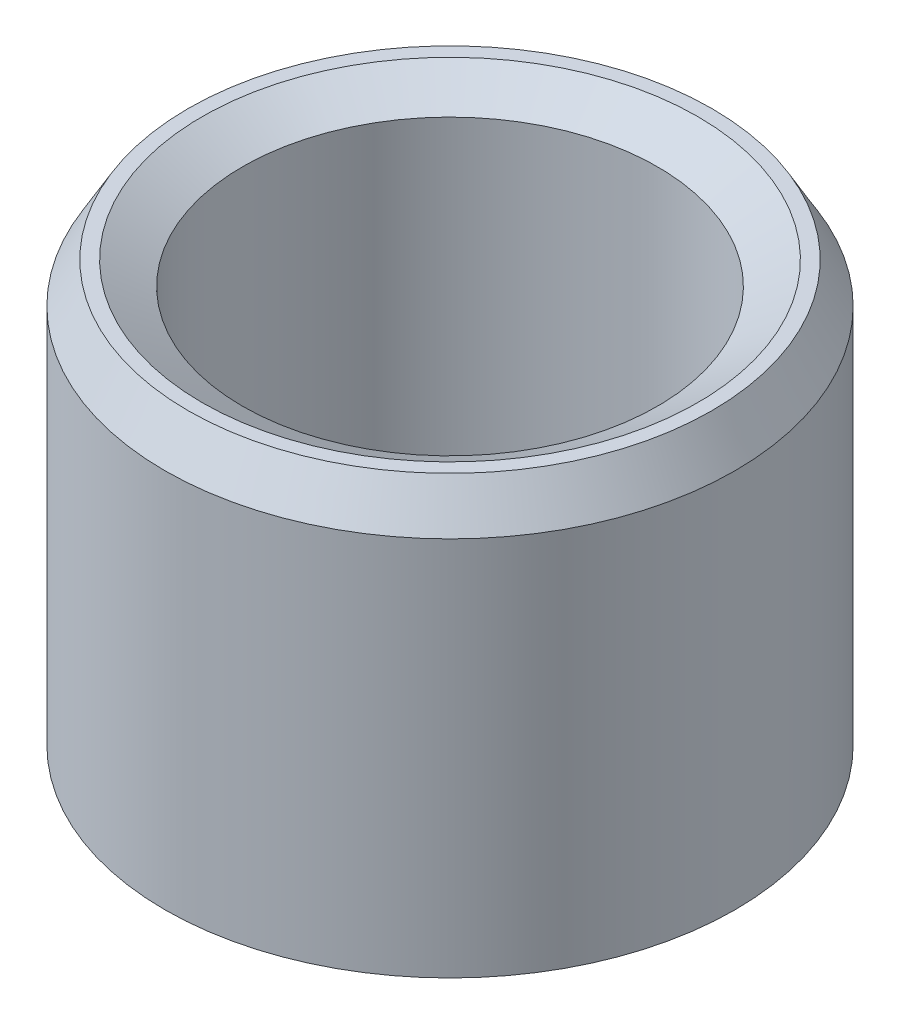
ISO-10303-21;
HEADER;
FILE_DESCRIPTION(('STEP AP214'),'2;1');
FILE_NAME('part.step','',(''),(''),'','','');
FILE_SCHEMA(('AUTOMOTIVE_DESIGN { 1 0 10303 214 1 1 1 1 }'));
ENDSEC;
DATA;
#1=APPLICATION_CONTEXT('core data for automotive mechanical design processes');
#2=APPLICATION_PROTOCOL_DEFINITION('international standard','automotive_design',2000,#1);
#3=PRODUCT_CONTEXT('',#1,'mechanical');
#4=PRODUCT('Part','Part','',(#3));
#5=PRODUCT_RELATED_PRODUCT_CATEGORY('part','',(#4));
#6=PRODUCT_DEFINITION_FORMATION('','',#4);
#7=PRODUCT_DEFINITION_CONTEXT('part definition',#1,'design');
#8=PRODUCT_DEFINITION('design','',#6,#7);
#9=PRODUCT_DEFINITION_SHAPE('','',#8);
#10=(LENGTH_UNIT() NAMED_UNIT(*) SI_UNIT(.MILLI.,.METRE.));
#11=(NAMED_UNIT(*) PLANE_ANGLE_UNIT() SI_UNIT($,.RADIAN.));
#12=(NAMED_UNIT(*) SI_UNIT($,.STERADIAN.) SOLID_ANGLE_UNIT());
#13=UNCERTAINTY_MEASURE_WITH_UNIT(LENGTH_MEASURE(1.E-05),#10,'distance_accuracy_value','');
#14=(GEOMETRIC_REPRESENTATION_CONTEXT(3) GLOBAL_UNCERTAINTY_ASSIGNED_CONTEXT((#13)) GLOBAL_UNIT_ASSIGNED_CONTEXT((#10,
#11,#12)) REPRESENTATION_CONTEXT('',''));
#15=CARTESIAN_POINT('',(0.,0.,0.));
#16=DIRECTION('',(0.,0.,1.));
#17=DIRECTION('',(1.,0.,0.));
#18=AXIS2_PLACEMENT_3D('',#15,#16,#17);
#19=CARTESIAN_POINT('',(0.,19.4621210670996,0.));
#20=DIRECTION('',(0.,-1.,0.));
#21=DIRECTION('',(0.,0.,-1.));
#22=AXIS2_PLACEMENT_3D('',#19,#20,#21);
#23=CYLINDRICAL_SURFACE('',#22,12.5);
#24=CARTESIAN_POINT('',(0.,1.02047988390466,0.));
#25=DIRECTION('',(0.,1.,0.));
#26=DIRECTION('',(0.,0.,1.));
#27=AXIS2_PLACEMENT_3D('',#24,#25,#26);
#28=CIRCLE('',#27,12.5);
#29=CARTESIAN_POINT('',(0.,1.02047988390466,12.5));
#30=VERTEX_POINT('',#29);
#31=EDGE_CURVE('E10',#30,#30,#28,.T.);
#32=ORIENTED_EDGE('',*,*,#31,.T.);
#33=EDGE_LOOP('',(#32));
#34=FACE_BOUND('',#33,.T.);
#35=CARTESIAN_POINT('',(0.,17.6945980600747,0.));
#36=DIRECTION('',(0.,1.,0.));
#37=DIRECTION('',(0.,0.,1.));
#38=AXIS2_PLACEMENT_3D('',#35,#36,#37);
#39=CIRCLE('',#38,12.5);
#40=CARTESIAN_POINT('',(0.,17.6945980600747,12.5));
#41=VERTEX_POINT('',#40);
#42=EDGE_CURVE('E50',#41,#41,#39,.F.);
#43=ORIENTED_EDGE('',*,*,#42,.T.);
#44=EDGE_LOOP('',(#43));
#45=FACE_BOUND('',#44,.T.);
#46=ADVANCED_FACE('F39',(#34,#45),#23,.T.);
#47=CARTESIAN_POINT('',(0.,19.4621210670996,0.));
#48=DIRECTION('',(0.,1.,0.));
#49=DIRECTION('',(0.,0.,1.));
#50=AXIS2_PLACEMENT_3D('',#47,#48,#49);
#51=PLANE('',#50);
#52=CARTESIAN_POINT('',(0.,19.4621210670996,0.));
#53=DIRECTION('',(0.,1.,0.));
#54=DIRECTION('',(0.,0.,1.));
#55=AXIS2_PLACEMENT_3D('',#52,#53,#54);
#56=CIRCLE('',#55,10.8651623211165);
#57=CARTESIAN_POINT('',(0.,19.4621210670996,10.8651623211165));
#58=VERTEX_POINT('',#57);
#59=EDGE_CURVE('E58',#58,#58,#56,.F.);
#60=ORIENTED_EDGE('',*,*,#59,.T.);
#61=EDGE_LOOP('',(#60));
#62=FACE_BOUND('',#61,.T.);
#63=CARTESIAN_POINT('',(0.,19.4621210670996,0.));
#64=DIRECTION('',(0.,1.,0.));
#65=DIRECTION('',(0.,0.,1.));
#66=AXIS2_PLACEMENT_3D('',#63,#64,#65);
#67=CIRCLE('',#66,11.4795201160953);
#68=CARTESIAN_POINT('',(0.,19.4621210670996,11.4795201160953));
#69=VERTEX_POINT('',#68);
#70=EDGE_CURVE('E61',#69,#69,#67,.T.);
#71=ORIENTED_EDGE('',*,*,#70,.T.);
#72=EDGE_LOOP('',(#71));
#73=FACE_BOUND('',#72,.T.);
#74=ADVANCED_FACE('F88',(#62,#73),#51,.T.);
#75=CARTESIAN_POINT('',(0.,0.,0.));
#76=DIRECTION('',(0.,1.,0.));
#77=DIRECTION('',(0.,0.,1.));
#78=AXIS2_PLACEMENT_3D('',#75,#76,#77);
#79=PLANE('',#78);
#80=CARTESIAN_POINT('',(0.,0.,0.));
#81=DIRECTION('',(0.,1.,0.));
#82=DIRECTION('',(0.,0.,1.));
#83=AXIS2_PLACEMENT_3D('',#80,#81,#82);
#84=CIRCLE('',#83,10.1181191979963);
#85=CARTESIAN_POINT('',(0.,0.,10.1181191979963));
#86=VERTEX_POINT('',#85);
#87=EDGE_CURVE('E51',#86,#86,#84,.T.);
#88=ORIENTED_EDGE('',*,*,#87,.T.);
#89=EDGE_LOOP('',(#88));
#90=FACE_BOUND('',#89,.T.);
#91=CARTESIAN_POINT('',(0.,0.,0.));
#92=DIRECTION('',(0.,1.,0.));
#93=DIRECTION('',(0.,0.,1.));
#94=AXIS2_PLACEMENT_3D('',#91,#92,#93);
#95=CIRCLE('',#94,10.7324769929751);
#96=CARTESIAN_POINT('',(0.,0.,10.7324769929751));
#97=VERTEX_POINT('',#96);
#98=EDGE_CURVE('E54',#97,#97,#95,.F.);
#99=ORIENTED_EDGE('',*,*,#98,.T.);
#100=EDGE_LOOP('',(#99));
#101=FACE_BOUND('',#100,.T.);
#102=ADVANCED_FACE('F83',(#90,#101),#79,.F.);
#103=CARTESIAN_POINT('',(0.,19.4621210670996,0.));
#104=DIRECTION('',(0.,-1.,0.));
#105=DIRECTION('',(0.,0.,-1.));
#106=AXIS2_PLACEMENT_3D('',#103,#104,#105);
#107=CYLINDRICAL_SURFACE('',#106,9.09763931409165);
#108=CARTESIAN_POINT('',(0.,18.4416411831949,0.));
#109=DIRECTION('',(0.,1.,0.));
#110=DIRECTION('',(0.,0.,1.));
#111=AXIS2_PLACEMENT_3D('',#108,#109,#110);
#112=CIRCLE('',#111,9.09763931409165);
#113=CARTESIAN_POINT('',(0.,18.4416411831949,9.09763931409165));
#114=VERTEX_POINT('',#113);
#115=EDGE_CURVE('E67',#114,#114,#112,.T.);
#116=ORIENTED_EDGE('',*,*,#115,.T.);
#117=EDGE_LOOP('',(#116));
#118=FACE_BOUND('',#117,.T.);
#119=CARTESIAN_POINT('',(0.,1.76752300702487,0.));
#120=DIRECTION('',(0.,1.,0.));
#121=DIRECTION('',(0.,0.,1.));
#122=AXIS2_PLACEMENT_3D('',#119,#120,#121);
#123=CIRCLE('',#122,9.09763931409165);
#124=CARTESIAN_POINT('',(0.,1.76752300702487,9.09763931409165));
#125=VERTEX_POINT('',#124);
#126=EDGE_CURVE('E69',#125,#125,#123,.F.);
#127=ORIENTED_EDGE('',*,*,#126,.T.);
#128=EDGE_LOOP('',(#127));
#129=FACE_BOUND('',#128,.T.);
#130=ADVANCED_FACE('F71',(#118,#129),#107,.F.);
#131=CARTESIAN_POINT('',(0.,18.4416411831949,0.));
#132=DIRECTION('',(0.,1.,0.));
#133=DIRECTION('',(0.,0.,1.));
#134=AXIS2_PLACEMENT_3D('',#131,#132,#133);
#135=CONICAL_SURFACE('',#134,9.09763931409165,1.0471975511966);
#136=ORIENTED_EDGE('',*,*,#59,.F.);
#137=EDGE_LOOP('',(#136));
#138=FACE_BOUND('',#137,.T.);
#139=ORIENTED_EDGE('',*,*,#115,.F.);
#140=EDGE_LOOP('',(#139));
#141=FACE_BOUND('',#140,.T.);
#142=ADVANCED_FACE('F77',(#138,#141),#135,.F.);
#143=CARTESIAN_POINT('',(0.,0.,0.));
#144=DIRECTION('',(0.,-1.,0.));
#145=DIRECTION('',(0.,0.,-1.));
#146=AXIS2_PLACEMENT_3D('',#143,#144,#145);
#147=CONICAL_SURFACE('',#146,10.1181191979963,0.523598775598295);
#148=ORIENTED_EDGE('',*,*,#126,.F.);
#149=EDGE_LOOP('',(#148));
#150=FACE_BOUND('',#149,.T.);
#151=ORIENTED_EDGE('',*,*,#87,.F.);
#152=EDGE_LOOP('',(#151));
#153=FACE_BOUND('',#152,.T.);
#154=ADVANCED_FACE('F73',(#150,#153),#147,.F.);
#155=CARTESIAN_POINT('',(0.,1.02047988390466,0.));
#156=DIRECTION('',(0.,1.,0.));
#157=DIRECTION('',(0.,0.,1.));
#158=AXIS2_PLACEMENT_3D('',#155,#156,#157);
#159=CONICAL_SURFACE('',#158,12.5,1.0471975511966);
#160=ORIENTED_EDGE('',*,*,#98,.F.);
#161=EDGE_LOOP('',(#160));
#162=FACE_BOUND('',#161,.T.);
#163=ORIENTED_EDGE('',*,*,#31,.F.);
#164=EDGE_LOOP('',(#163));
#165=FACE_BOUND('',#164,.T.);
#166=ADVANCED_FACE('F76',(#162,#165),#159,.T.);
#167=CARTESIAN_POINT('',(0.,19.4621210670996,0.));
#168=DIRECTION('',(0.,-1.,0.));
#169=DIRECTION('',(0.,0.,-1.));
#170=AXIS2_PLACEMENT_3D('',#167,#168,#169);
#171=CONICAL_SURFACE('',#170,11.4795201160953,0.523598775598295);
#172=ORIENTED_EDGE('',*,*,#42,.F.);
#173=EDGE_LOOP('',(#172));
#174=FACE_BOUND('',#173,.T.);
#175=ORIENTED_EDGE('',*,*,#70,.F.);
#176=EDGE_LOOP('',(#175));
#177=FACE_BOUND('',#176,.T.);
#178=ADVANCED_FACE('F45',(#174,#177),#171,.T.);
#179=CLOSED_SHELL('',(#46,#74,#102,#130,#142,#154,#166,#178));
#180=MANIFOLD_SOLID_BREP('B2',#179);
#181=ADVANCED_BREP_SHAPE_REPRESENTATION('',(#18,#180),#14);
#182=SHAPE_DEFINITION_REPRESENTATION(#9,#181);
ENDSEC;
END-ISO-10303-21;
